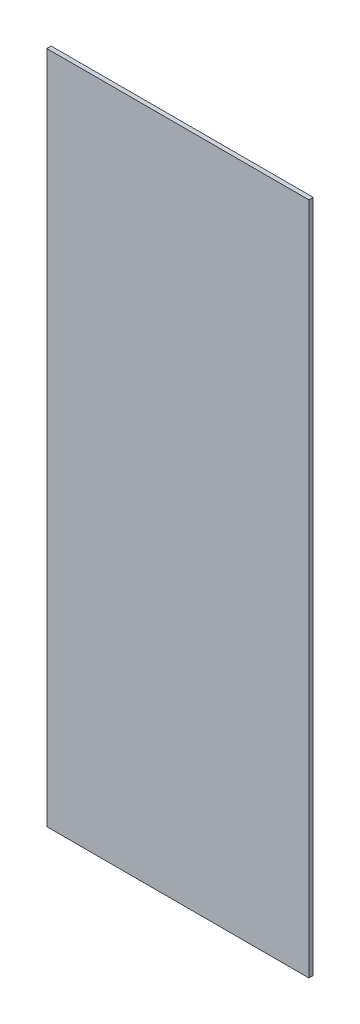
ISO-10303-21;
HEADER;
FILE_DESCRIPTION(('STEP AP214'),'2;1');
FILE_NAME('part.step','',(''),(''),'','','');
FILE_SCHEMA(('AUTOMOTIVE_DESIGN { 1 0 10303 214 1 1 1 1 }'));
ENDSEC;
DATA;
#1=APPLICATION_CONTEXT('core data for automotive mechanical design processes');
#2=APPLICATION_PROTOCOL_DEFINITION('international standard','automotive_design',2000,#1);
#3=PRODUCT_CONTEXT('',#1,'mechanical');
#4=PRODUCT('Part','Part','',(#3));
#5=PRODUCT_RELATED_PRODUCT_CATEGORY('part','',(#4));
#6=PRODUCT_DEFINITION_FORMATION('','',#4);
#7=PRODUCT_DEFINITION_CONTEXT('part definition',#1,'design');
#8=PRODUCT_DEFINITION('design','',#6,#7);
#9=PRODUCT_DEFINITION_SHAPE('','',#8);
#10=(LENGTH_UNIT() NAMED_UNIT(*) SI_UNIT(.MILLI.,.METRE.));
#11=(NAMED_UNIT(*) PLANE_ANGLE_UNIT() SI_UNIT($,.RADIAN.));
#12=(NAMED_UNIT(*) SI_UNIT($,.STERADIAN.) SOLID_ANGLE_UNIT());
#13=UNCERTAINTY_MEASURE_WITH_UNIT(LENGTH_MEASURE(1.E-05),#10,'distance_accuracy_value','');
#14=(GEOMETRIC_REPRESENTATION_CONTEXT(3) GLOBAL_UNCERTAINTY_ASSIGNED_CONTEXT((#13)) GLOBAL_UNIT_ASSIGNED_CONTEXT((#10,
#11,#12)) REPRESENTATION_CONTEXT('',''));
#15=CARTESIAN_POINT('',(0.,0.,0.));
#16=DIRECTION('',(0.,0.,1.));
#17=DIRECTION('',(1.,0.,0.));
#18=AXIS2_PLACEMENT_3D('',#15,#16,#17);
#19=CARTESIAN_POINT('',(0.,0.,-10.));
#20=DIRECTION('',(-1.,0.,0.));
#21=DIRECTION('',(0.,-1.,0.));
#22=AXIS2_PLACEMENT_3D('',#19,#20,#21);
#23=PLANE('',#22);
#24=DIRECTION('',(0.,-1.,0.));
#25=VECTOR('',#24,1.);
#26=CARTESIAN_POINT('',(0.,0.,0.));
#27=LINE('',#26,#25);
#28=CARTESIAN_POINT('',(1.48077726306863E-12,-4457.,0.));
#29=VERTEX_POINT('',#28);
#30=CARTESIAN_POINT('',(1.99840144432528E-12,-6015.,0.));
#31=VERTEX_POINT('',#30);
#32=EDGE_CURVE('E96',#29,#31,#27,.T.);
#33=ORIENTED_EDGE('',*,*,#32,.F.);
#34=DIRECTION('',(0.,0.,1.));
#35=VECTOR('',#34,1.);
#36=CARTESIAN_POINT('',(1.48077726306863E-12,-4457.,-10.));
#37=LINE('',#36,#35);
#38=CARTESIAN_POINT('',(1.48077726306863E-12,-4457.,-10.));
#39=VERTEX_POINT('',#38);
#40=EDGE_CURVE('E87',#39,#29,#37,.T.);
#41=ORIENTED_EDGE('',*,*,#40,.F.);
#42=DIRECTION('',(0.,-1.,0.));
#43=VECTOR('',#42,1.);
#44=CARTESIAN_POINT('',(0.,0.,-10.));
#45=LINE('',#44,#43);
#46=CARTESIAN_POINT('',(1.99840144432528E-12,-6015.,-10.));
#47=VERTEX_POINT('',#46);
#48=EDGE_CURVE('E80',#39,#47,#45,.T.);
#49=ORIENTED_EDGE('',*,*,#48,.T.);
#50=DIRECTION('',(0.,0.,1.));
#51=VECTOR('',#50,1.);
#52=CARTESIAN_POINT('',(1.99840144432528E-12,-6015.,-10.));
#53=LINE('',#52,#51);
#54=EDGE_CURVE('E90',#47,#31,#53,.T.);
#55=ORIENTED_EDGE('',*,*,#54,.T.);
#56=EDGE_LOOP('',(#33,#41,#49,#55));
#57=FACE_BOUND('',#56,.T.);
#58=ADVANCED_FACE('F38',(#57),#23,.T.);
#59=CARTESIAN_POINT('',(0.,0.,-10.));
#60=DIRECTION('',(0.,0.,1.));
#61=DIRECTION('',(1.,0.,0.));
#62=AXIS2_PLACEMENT_3D('',#59,#60,#61);
#63=PLANE('',#62);
#64=DIRECTION('',(-1.,0.,0.));
#65=VECTOR('',#64,1.);
#66=CARTESIAN_POINT('',(0.,-4457.,-10.));
#67=LINE('',#66,#65);
#68=CARTESIAN_POINT('',(606.000000000002,-4457.,-10.));
#69=VERTEX_POINT('',#68);
#70=EDGE_CURVE('E104',#69,#39,#67,.T.);
#71=ORIENTED_EDGE('',*,*,#70,.F.);
#72=DIRECTION('',(0.,1.,0.));
#73=VECTOR('',#72,1.);
#74=CARTESIAN_POINT('',(606.000000000002,-6015.,-10.));
#75=LINE('',#74,#73);
#76=CARTESIAN_POINT('',(606.000000000002,-6015.,-10.));
#77=VERTEX_POINT('',#76);
#78=EDGE_CURVE('E51',#77,#69,#75,.T.);
#79=ORIENTED_EDGE('',*,*,#78,.F.);
#80=DIRECTION('',(1.,0.,0.));
#81=VECTOR('',#80,1.);
#82=CARTESIAN_POINT('',(1.99840144432528E-12,-6015.,-10.));
#83=LINE('',#82,#81);
#84=EDGE_CURVE('E99',#47,#77,#83,.T.);
#85=ORIENTED_EDGE('',*,*,#84,.F.);
#86=ORIENTED_EDGE('',*,*,#48,.F.);
#87=EDGE_LOOP('',(#71,#79,#85,#86));
#88=FACE_BOUND('',#87,.T.);
#89=ADVANCED_FACE('F110',(#88),#63,.F.);
#90=CARTESIAN_POINT('',(0.,0.,0.));
#91=DIRECTION('',(0.,0.,1.));
#92=DIRECTION('',(1.,0.,0.));
#93=AXIS2_PLACEMENT_3D('',#90,#91,#92);
#94=PLANE('',#93);
#95=DIRECTION('',(0.,1.,0.));
#96=VECTOR('',#95,1.);
#97=CARTESIAN_POINT('',(606.000000000002,-6015.,0.));
#98=LINE('',#97,#96);
#99=CARTESIAN_POINT('',(606.000000000002,-6015.,0.));
#100=VERTEX_POINT('',#99);
#101=CARTESIAN_POINT('',(606.000000000002,-4457.,0.));
#102=VERTEX_POINT('',#101);
#103=EDGE_CURVE('E76',#100,#102,#98,.T.);
#104=ORIENTED_EDGE('',*,*,#103,.T.);
#105=DIRECTION('',(-1.,0.,0.));
#106=VECTOR('',#105,1.);
#107=CARTESIAN_POINT('',(0.,-4457.,0.));
#108=LINE('',#107,#106);
#109=EDGE_CURVE('E45',#102,#29,#108,.T.);
#110=ORIENTED_EDGE('',*,*,#109,.T.);
#111=ORIENTED_EDGE('',*,*,#32,.T.);
#112=DIRECTION('',(1.,0.,0.));
#113=VECTOR('',#112,1.);
#114=CARTESIAN_POINT('',(1.99840144432528E-12,-6015.,0.));
#115=LINE('',#114,#113);
#116=EDGE_CURVE('E79',#31,#100,#115,.T.);
#117=ORIENTED_EDGE('',*,*,#116,.T.);
#118=EDGE_LOOP('',(#104,#110,#111,#117));
#119=FACE_BOUND('',#118,.T.);
#120=ADVANCED_FACE('F77',(#119),#94,.T.);
#121=CARTESIAN_POINT('',(606.000000000002,-6015.,-10.));
#122=DIRECTION('',(1.,0.,0.));
#123=DIRECTION('',(0.,1.,0.));
#124=AXIS2_PLACEMENT_3D('',#121,#122,#123);
#125=PLANE('',#124);
#126=ORIENTED_EDGE('',*,*,#78,.T.);
#127=DIRECTION('',(0.,0.,1.));
#128=VECTOR('',#127,1.);
#129=CARTESIAN_POINT('',(606.000000000002,-4457.,-10.));
#130=LINE('',#129,#128);
#131=EDGE_CURVE('E11',#69,#102,#130,.T.);
#132=ORIENTED_EDGE('',*,*,#131,.T.);
#133=ORIENTED_EDGE('',*,*,#103,.F.);
#134=DIRECTION('',(0.,0.,1.));
#135=VECTOR('',#134,1.);
#136=CARTESIAN_POINT('',(606.000000000002,-6015.,-10.));
#137=LINE('',#136,#135);
#138=EDGE_CURVE('E89',#77,#100,#137,.T.);
#139=ORIENTED_EDGE('',*,*,#138,.F.);
#140=EDGE_LOOP('',(#126,#132,#133,#139));
#141=FACE_BOUND('',#140,.T.);
#142=ADVANCED_FACE('F82',(#141),#125,.T.);
#143=CARTESIAN_POINT('',(1.99840144432528E-12,-6015.,-10.));
#144=DIRECTION('',(0.,-1.,0.));
#145=DIRECTION('',(0.,0.,-1.));
#146=AXIS2_PLACEMENT_3D('',#143,#144,#145);
#147=PLANE('',#146);
#148=ORIENTED_EDGE('',*,*,#116,.F.);
#149=ORIENTED_EDGE('',*,*,#54,.F.);
#150=ORIENTED_EDGE('',*,*,#84,.T.);
#151=ORIENTED_EDGE('',*,*,#138,.T.);
#152=EDGE_LOOP('',(#148,#149,#150,#151));
#153=FACE_BOUND('',#152,.T.);
#154=ADVANCED_FACE('F112',(#153),#147,.T.);
#155=CARTESIAN_POINT('',(0.,-4457.,-10.));
#156=DIRECTION('',(0.,1.,0.));
#157=DIRECTION('',(0.,0.,1.));
#158=AXIS2_PLACEMENT_3D('',#155,#156,#157);
#159=PLANE('',#158);
#160=ORIENTED_EDGE('',*,*,#131,.F.);
#161=ORIENTED_EDGE('',*,*,#70,.T.);
#162=ORIENTED_EDGE('',*,*,#40,.T.);
#163=ORIENTED_EDGE('',*,*,#109,.F.);
#164=EDGE_LOOP('',(#160,#161,#162,#163));
#165=FACE_BOUND('',#164,.T.);
#166=ADVANCED_FACE('F85',(#165),#159,.T.);
#167=CLOSED_SHELL('',(#58,#89,#120,#142,#154,#166));
#168=MANIFOLD_SOLID_BREP('B2',#167);
#169=ADVANCED_BREP_SHAPE_REPRESENTATION('',(#18,#168),#14);
#170=SHAPE_DEFINITION_REPRESENTATION(#9,#169);
ENDSEC;
END-ISO-10303-21;
